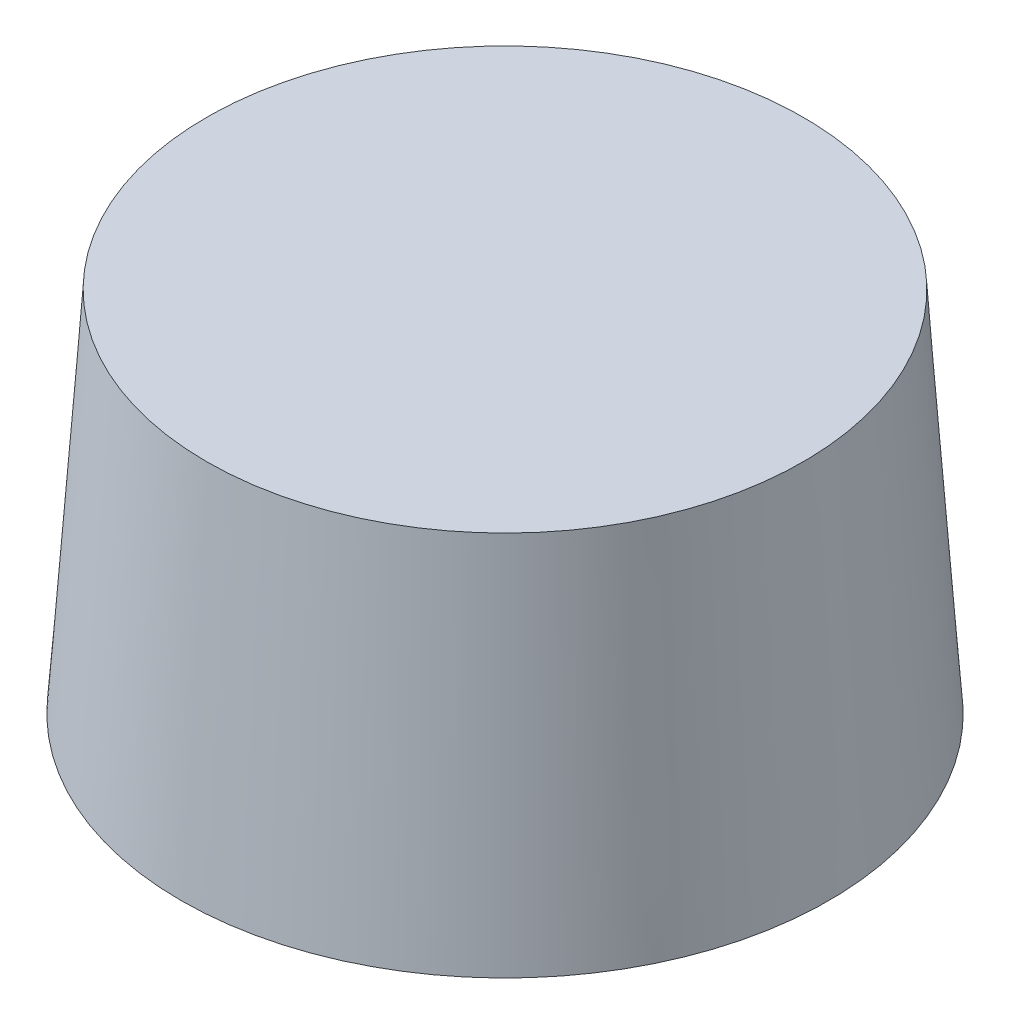
ISO-10303-21;
HEADER;
FILE_DESCRIPTION(('STEP AP214'),'2;1');
FILE_NAME('part.step','',(''),(''),'','','');
FILE_SCHEMA(('AUTOMOTIVE_DESIGN { 1 0 10303 214 1 1 1 1 }'));
ENDSEC;
DATA;
#1=APPLICATION_CONTEXT('core data for automotive mechanical design processes');
#2=APPLICATION_PROTOCOL_DEFINITION('international standard','automotive_design',2000,#1);
#3=PRODUCT_CONTEXT('',#1,'mechanical');
#4=PRODUCT('Part','Part','',(#3));
#5=PRODUCT_RELATED_PRODUCT_CATEGORY('part','',(#4));
#6=PRODUCT_DEFINITION_FORMATION('','',#4);
#7=PRODUCT_DEFINITION_CONTEXT('part definition',#1,'design');
#8=PRODUCT_DEFINITION('design','',#6,#7);
#9=PRODUCT_DEFINITION_SHAPE('','',#8);
#10=(LENGTH_UNIT() NAMED_UNIT(*) SI_UNIT(.MILLI.,.METRE.));
#11=(NAMED_UNIT(*) PLANE_ANGLE_UNIT() SI_UNIT($,.RADIAN.));
#12=(NAMED_UNIT(*) SI_UNIT($,.STERADIAN.) SOLID_ANGLE_UNIT());
#13=UNCERTAINTY_MEASURE_WITH_UNIT(LENGTH_MEASURE(1.E-05),#10,'distance_accuracy_value','');
#14=(GEOMETRIC_REPRESENTATION_CONTEXT(3) GLOBAL_UNCERTAINTY_ASSIGNED_CONTEXT((#13)) GLOBAL_UNIT_ASSIGNED_CONTEXT((#10,
#11,#12)) REPRESENTATION_CONTEXT('',''));
#15=CARTESIAN_POINT('',(0.,0.,0.));
#16=DIRECTION('',(0.,0.,1.));
#17=DIRECTION('',(1.,0.,0.));
#18=AXIS2_PLACEMENT_3D('',#15,#16,#17);
#19=CARTESIAN_POINT('',(0.,40.,0.));
#20=DIRECTION('',(0.,-1.,0.));
#21=DIRECTION('',(0.,0.,1.));
#22=AXIS2_PLACEMENT_3D('',#19,#20,#21);
#23=CONICAL_SURFACE('',#22,32.5,0.069813170079774);
#24=CARTESIAN_POINT('',(0.,40.,0.));
#25=DIRECTION('',(0.,1.,0.));
#26=DIRECTION('',(0.,0.,1.));
#27=AXIS2_PLACEMENT_3D('',#24,#25,#26);
#28=CIRCLE('',#27,32.5);
#29=CARTESIAN_POINT('',(0.,40.,32.5));
#30=VERTEX_POINT('',#29);
#31=EDGE_CURVE('E10',#30,#30,#28,.T.);
#32=ORIENTED_EDGE('',*,*,#31,.F.);
#33=EDGE_LOOP('',(#32));
#34=FACE_BOUND('',#33,.T.);
#35=CARTESIAN_POINT('',(0.,0.,0.));
#36=DIRECTION('',(0.,1.,0.));
#37=DIRECTION('',(0.,0.,1.));
#38=AXIS2_PLACEMENT_3D('',#35,#36,#37);
#39=CIRCLE('',#38,35.2970724777404);
#40=CARTESIAN_POINT('',(0.,0.,35.2970724777404));
#41=VERTEX_POINT('',#40);
#42=EDGE_CURVE('E37',#41,#41,#39,.T.);
#43=ORIENTED_EDGE('',*,*,#42,.T.);
#44=EDGE_LOOP('',(#43));
#45=FACE_BOUND('',#44,.T.);
#46=ADVANCED_FACE('F34',(#34,#45),#23,.T.);
#47=CARTESIAN_POINT('',(0.,40.,0.));
#48=DIRECTION('',(0.,1.,0.));
#49=DIRECTION('',(0.,0.,1.));
#50=AXIS2_PLACEMENT_3D('',#47,#48,#49);
#51=PLANE('',#50);
#52=ORIENTED_EDGE('',*,*,#31,.T.);
#53=EDGE_LOOP('',(#52));
#54=FACE_BOUND('',#53,.T.);
#55=ADVANCED_FACE('F49',(#54),#51,.T.);
#56=CARTESIAN_POINT('',(0.,0.,0.));
#57=DIRECTION('',(0.,1.,0.));
#58=DIRECTION('',(0.,0.,1.));
#59=AXIS2_PLACEMENT_3D('',#56,#57,#58);
#60=PLANE('',#59);
#61=ORIENTED_EDGE('',*,*,#42,.F.);
#62=EDGE_LOOP('',(#61));
#63=FACE_BOUND('',#62,.T.);
#64=ADVANCED_FACE('F47',(#63),#60,.F.);
#65=CLOSED_SHELL('',(#46,#55,#64));
#66=MANIFOLD_SOLID_BREP('B2',#65);
#67=ADVANCED_BREP_SHAPE_REPRESENTATION('',(#18,#66),#14);
#68=SHAPE_DEFINITION_REPRESENTATION(#9,#67);
ENDSEC;
END-ISO-10303-21;
